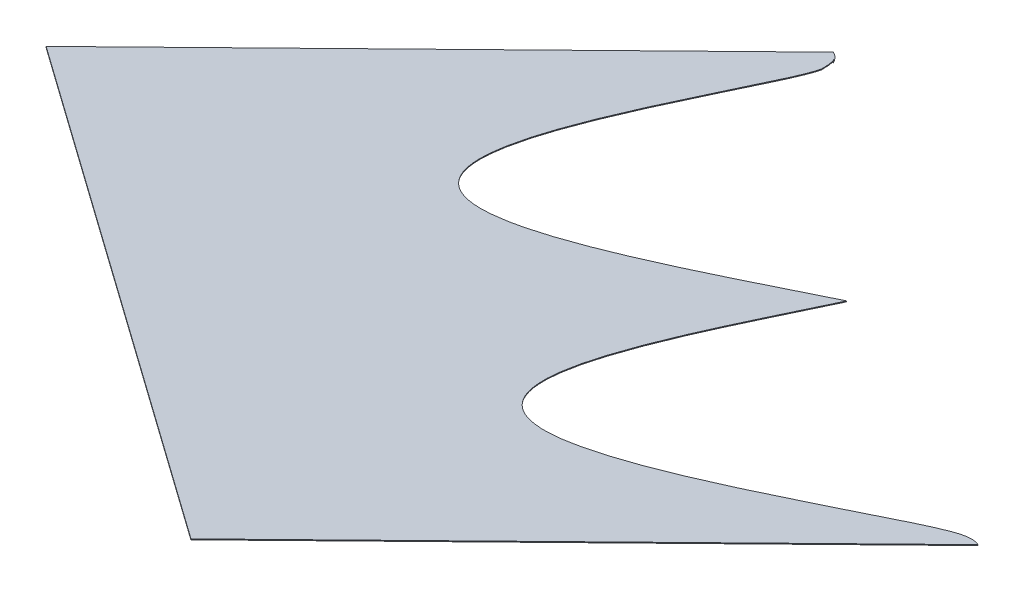
ISO-10303-21;
HEADER;
FILE_DESCRIPTION(('STEP AP214'),'2;1');
FILE_NAME('part.step','',(''),(''),'','','');
FILE_SCHEMA(('AUTOMOTIVE_DESIGN { 1 0 10303 214 1 1 1 1 }'));
ENDSEC;
DATA;
#1=APPLICATION_CONTEXT('core data for automotive mechanical design processes');
#2=APPLICATION_PROTOCOL_DEFINITION('international standard','automotive_design',2000,#1);
#3=PRODUCT_CONTEXT('',#1,'mechanical');
#4=PRODUCT('Part','Part','',(#3));
#5=PRODUCT_RELATED_PRODUCT_CATEGORY('part','',(#4));
#6=PRODUCT_DEFINITION_FORMATION('','',#4);
#7=PRODUCT_DEFINITION_CONTEXT('part definition',#1,'design');
#8=PRODUCT_DEFINITION('design','',#6,#7);
#9=PRODUCT_DEFINITION_SHAPE('','',#8);
#10=(LENGTH_UNIT() NAMED_UNIT(*) SI_UNIT(.MILLI.,.METRE.));
#11=(NAMED_UNIT(*) PLANE_ANGLE_UNIT() SI_UNIT($,.RADIAN.));
#12=(NAMED_UNIT(*) SI_UNIT($,.STERADIAN.) SOLID_ANGLE_UNIT());
#13=UNCERTAINTY_MEASURE_WITH_UNIT(LENGTH_MEASURE(1.E-05),#10,'distance_accuracy_value','');
#14=(GEOMETRIC_REPRESENTATION_CONTEXT(3) GLOBAL_UNCERTAINTY_ASSIGNED_CONTEXT((#13)) GLOBAL_UNIT_ASSIGNED_CONTEXT((#10,
#11,#12)) REPRESENTATION_CONTEXT('',''));
#15=CARTESIAN_POINT('',(0.,0.,0.));
#16=DIRECTION('',(0.,0.,1.));
#17=DIRECTION('',(1.,0.,0.));
#18=AXIS2_PLACEMENT_3D('',#15,#16,#17);
#19=CARTESIAN_POINT('',(1079.11560137537,85.7924278431009,-318.004491804373));
#20=CARTESIAN_POINT('',(1079.25158330935,85.792450728008,-317.964564471529));
#21=CARTESIAN_POINT('',(1079.37115136888,85.7936431109959,-317.919641101963));
#22=B_SPLINE_CURVE_WITH_KNOTS('',2,(#19,#20,#21),.UNSPECIFIED.,.F.,.F.,(3,3),(0.,1.),.UNSPECIFIED.);
#23=DIRECTION('',(-0.0346317771892169,-0.992348088141897,0.118515450342299));
#24=VECTOR('',#23,1.);
#25=SURFACE_OF_LINEAR_EXTRUSION('',#22,#24);
#26=CARTESIAN_POINT('',(1079.11213819765,85.6931930342867,-317.992640259338));
#27=CARTESIAN_POINT('',(1079.24812013163,85.6932159191938,-317.952712926495));
#28=CARTESIAN_POINT('',(1079.36768819116,85.6944083021817,-317.907789556928));
#29=B_SPLINE_CURVE_WITH_KNOTS('',2,(#26,#27,#28),.UNSPECIFIED.,.F.,.F.,(3,3),(0.,1.),.UNSPECIFIED.);
#30=CARTESIAN_POINT('',(1079.11213819765,85.6931930342867,-317.992640259338));
#31=VERTEX_POINT('',#30);
#32=CARTESIAN_POINT('',(1079.36768819116,85.6944083021816,-317.907789556929));
#33=VERTEX_POINT('',#32);
#34=EDGE_CURVE('E190',#31,#33,#29,.T.);
#35=ORIENTED_EDGE('',*,*,#34,.F.);
#36=DIRECTION('',(-0.0346317771892169,-0.992348088141897,0.118515450342299));
#37=VECTOR('',#36,1.);
#38=CARTESIAN_POINT('',(1079.11560137537,85.7924278431009,-318.004491804372));
#39=LINE('',#38,#37);
#40=CARTESIAN_POINT('',(1079.11560137537,85.7924278431009,-318.004491804372));
#41=VERTEX_POINT('',#40);
#42=EDGE_CURVE('E13',#41,#31,#39,.T.);
#43=ORIENTED_EDGE('',*,*,#42,.F.);
#44=CARTESIAN_POINT('',(1079.37115136888,85.7936431109959,-317.919641101963));
#45=VERTEX_POINT('',#44);
#46=EDGE_CURVE('E344',#41,#45,#22,.T.);
#47=ORIENTED_EDGE('',*,*,#46,.T.);
#48=DIRECTION('',(-0.0346317771892169,-0.992348088141897,0.118515450342299));
#49=VECTOR('',#48,1.);
#50=CARTESIAN_POINT('',(1079.37115136888,85.7936431109959,-317.919641101963));
#51=LINE('',#50,#49);
#52=EDGE_CURVE('E128',#45,#33,#51,.T.);
#53=ORIENTED_EDGE('',*,*,#52,.T.);
#54=EDGE_LOOP('',(#35,#43,#47,#53));
#55=FACE_BOUND('',#54,.T.);
#56=ADVANCED_FACE('F58',(#55),#25,.T.);
#57=CARTESIAN_POINT('',(1079.11560137537,85.7924278431009,-318.004491804372));
#58=CARTESIAN_POINT('',(1078.81051230708,85.7933883671713,-318.08560023693));
#59=CARTESIAN_POINT('',(1078.19194149172,85.817644649016,-318.063253207468));
#60=CARTESIAN_POINT('',(1077.58193516638,85.8578302220282,-317.905025116934));
#61=CARTESIAN_POINT('',(1076.99590314881,85.9062234610284,-317.67106736828));
#62=CARTESIAN_POINT('',(1076.2066690221,85.9795604529384,-317.287630076734));
#63=CARTESIAN_POINT('',(1075.5827780901,86.0444550647695,-316.926566670148));
#64=CARTESIAN_POINT('',(1075.10486538717,86.0941656115252,-316.649985011849));
#65=CARTESIAN_POINT('',(1074.50831292347,86.1593358854223,-316.278624783506));
#66=CARTESIAN_POINT('',(1073.66118071325,86.2518807017246,-315.751276008385));
#67=CARTESIAN_POINT('',(1072.40099468496,86.3948515177153,-314.922402356252));
#68=CARTESIAN_POINT('',(1071.62840304332,86.4825037015613,-314.414238608018));
#69=CARTESIAN_POINT('',(1070.31340297579,86.6331733812299,-313.53691857154));
#70=CARTESIAN_POINT('',(1070.3014642302,86.6345412952079,-313.528953476348));
#71=CARTESIAN_POINT('',(1069.27116207446,86.7526356910174,-312.841198816756));
#72=CARTESIAN_POINT('',(1068.65455820699,86.8233115221574,-312.429598995665));
#73=CARTESIAN_POINT('',(1068.2282387323,86.872099604144,-312.145665055174));
#74=CARTESIAN_POINT('',(1067.06080122107,87.0057013755712,-311.368137514158));
#75=CARTESIAN_POINT('',(1066.13940176238,87.110336549803,-310.761256182334));
#76=CARTESIAN_POINT('',(1063.82251251541,87.373445137229,-309.235233110992));
#77=CARTESIAN_POINT('',(1061.94356775731,87.5803283533626,-308.052020564607));
#78=CARTESIAN_POINT('',(1059.64831198028,87.833049938153,-306.606647878244));
#79=CARTESIAN_POINT('',(1057.68485398648,88.037603818056,-305.467635104027));
#80=CARTESIAN_POINT('',(1055.31090560422,88.2849227593384,-304.090494599237));
#81=CARTESIAN_POINT('',(1053.2955238117,88.475095998243,-303.087065961794));
#82=CARTESIAN_POINT('',(1050.73266220442,88.7169299249603,-301.811055262439));
#83=CARTESIAN_POINT('',(1048.65788764754,88.8750304368261,-301.093531848681));
#84=CARTESIAN_POINT('',(1047.35293908793,88.9744692093659,-300.642238891495));
#85=CARTESIAN_POINT('',(1046.22453512211,89.0421299855224,-300.40543932607));
#86=CARTESIAN_POINT('',(1044.82782804648,89.1258786142603,-300.112335403581));
#87=CARTESIAN_POINT('',(1043.68894625372,89.1616776805252,-300.145380593177));
#88=CARTESIAN_POINT('',(1043.12539254736,89.1793921585387,-300.161732368393));
#89=CARTESIAN_POINT('',(1041.96923952346,89.1933132057905,-300.38301245651));
#90=CARTESIAN_POINT('',(1041.14065839689,89.1754723745019,-300.774518809856));
#91=CARTESIAN_POINT('',(1040.63754780833,89.1536324706326,-301.104403230339));
#92=CARTESIAN_POINT('',(1039.95521392498,89.1056329182009,-301.705697820187));
#93=CARTESIAN_POINT('',(1039.43861924964,89.0295509306826,-302.493699775034));
#94=CARTESIAN_POINT('',(1039.16885450018,88.9758493780716,-303.022179948545));
#95=CARTESIAN_POINT('',(1038.83424711106,88.8883497817988,-303.852604212521));
#96=CARTESIAN_POINT('',(1038.54713204883,88.7536168034094,-305.064642963268));
#97=CARTESIAN_POINT('',(1038.38770687923,88.6130031904483,-306.288608501277));
#98=CARTESIAN_POINT('',(1038.32523347803,88.4703814202857,-307.501058063288));
#99=CARTESIAN_POINT('',(1038.33225082657,88.2667512626605,-309.204034120615));
#100=CARTESIAN_POINT('',(1038.49264339123,88.0349344275506,-311.098203302017));
#101=CARTESIAN_POINT('',(1038.64138767135,87.8786112033686,-312.363656653869));
#102=CARTESIAN_POINT('',(1038.89072679115,87.6621281031865,-314.10344275892));
#103=CARTESIAN_POINT('',(1039.33008793638,87.3591347664427,-316.512065434913));
#104=CARTESIAN_POINT('',(1039.60535322406,87.1956670486443,-317.800369623763));
#105=CARTESIAN_POINT('',(1039.84161422798,87.0553622269126,-318.906124888394));
#106=CARTESIAN_POINT('',(1040.4024274629,86.7520932717532,-321.281565457838));
#107=CARTESIAN_POINT('',(1040.72389675444,86.5901029085434,-322.543998110448));
#108=CARTESIAN_POINT('',(1040.99844725728,86.4517552129944,-323.622177360211));
#109=CARTESIAN_POINT('',(1041.44480473919,86.2371760681495,-325.288449991425));
#110=CARTESIAN_POINT('',(1041.77461648188,86.0811184485172,-326.498769095649));
#111=CARTESIAN_POINT('',(1042.13878384908,85.9123178939733,-327.805747586732));
#112=CARTESIAN_POINT('',(1042.46950793571,85.7608817388234,-328.977103859341));
#113=CARTESIAN_POINT('',(1042.64123598148,85.6830297701716,-329.578789163876));
#114=CARTESIAN_POINT('',(1042.77360794149,85.6230196673696,-330.042582149525));
#115=CARTESIAN_POINT('',(1043.03424549293,85.5055330795497,-330.950153684593));
#116=CARTESIAN_POINT('',(1043.18008081047,85.4399234510108,-331.456898189614));
#117=CARTESIAN_POINT('',(1043.28683729763,85.3919346872526,-331.827519833998));
#118=CARTESIAN_POINT('',(1043.38650585486,85.3471567727719,-332.173327730276));
#119=CARTESIAN_POINT('',(1043.51814425932,85.2879633634768,-332.630496770223));
#120=CARTESIAN_POINT('',(1043.66084060617,85.2237646299408,-333.126344883072));
#121=CARTESIAN_POINT('',(1043.82310029574,85.1506481476863,-333.691146010414));
#122=CARTESIAN_POINT('',(1043.95044313584,85.0931195799746,-334.135630296347));
#123=CARTESIAN_POINT('',(1044.00357355406,85.0689993328928,-334.322067425072));
#124=CARTESIAN_POINT('',(1044.40366330488,84.8873658361532,-335.726001120177));
#125=CARTESIAN_POINT('',(1044.6549793891,84.7672684803609,-336.658156872522));
#126=B_SPLINE_CURVE_WITH_KNOTS('',2,(#57,#58,#59,#60,#61,#62,#63,#64,#65,#66,#67,#68,#69,#70,
#71,#72,#73,#74,#75,#76,#77,#78,#79,#80,#81,#82,#83,#84,#85,#86,#87,#88,#89,#90,#91,#92,#93,#94,
#95,#96,#97,#98,#99,#100,#101,#102,#103,#104,#105,#106,#107,#108,#109,#110,#111,#112,#113,#114,
#115,#116,#117,#118,#119,#120,#121,#122,#123,#124,#125),.UNSPECIFIED.,.F.,.F.,(3,1,1,1,1,2,2,2,
2,2,2,2,2,2,2,2,2,2,1,1,1,1,1,1,1,1,1,1,1,1,1,1,1,2,1,2,1,1,1,1,2,1,1,1,1,1,1,1,1,2,3),(0.,
0.0078125,0.015625,0.0234375,0.03125,0.046875,0.0625,0.09375,0.125,0.140625,0.15625,0.1875,0.25,
0.3125,0.375,0.4375,0.46875,0.5,0.513179779052734,0.528392910957336,0.535999476909637,
0.543606042861938,0.558819174766541,0.566425740718842,0.574032306671143,0.589245438575745,
0.604458570480347,0.619671702384949,0.634884834289551,0.665311098098755,0.680524230003357,
0.695737361907959,0.726163625717163,0.756589889526367,0.787016153335571,0.817442417144775,
0.847868680953979,0.860039186477661,0.878294944763184,0.893508076667786,0.908721208572388,
0.92393434047699,0.931540906429291,0.935344189405441,0.939147472381592,0.943494081497192,
0.946754038333893,0.954360604286194,0.961967170238495,0.969573736190796,1.),.UNSPECIFIED.);
#127=DIRECTION('',(-0.0346317771892169,-0.992348088141897,0.118515450342299));
#128=VECTOR('',#127,1.);
#129=SURFACE_OF_LINEAR_EXTRUSION('',#126,#128);
#130=CARTESIAN_POINT('',(1079.11213819765,85.6931930342867,-317.992640259338));
#131=CARTESIAN_POINT('',(1078.80704912936,85.6941535583571,-318.073748691895));
#132=CARTESIAN_POINT('',(1078.188478314,85.7184098402018,-318.051401662433));
#133=CARTESIAN_POINT('',(1077.57847198866,85.7585954132139,-317.8931735719));
#134=CARTESIAN_POINT('',(1076.99243997109,85.8069886522142,-317.659215823245));
#135=CARTESIAN_POINT('',(1076.20320584438,85.8803256441242,-317.2757785317));
#136=CARTESIAN_POINT('',(1075.57931491238,85.9452202559553,-316.914715125113));
#137=CARTESIAN_POINT('',(1075.10140220945,85.994930802711,-316.638133466814));
#138=CARTESIAN_POINT('',(1074.50484974575,86.0601010766081,-316.266773238472));
#139=CARTESIAN_POINT('',(1073.65771753554,86.1526458929104,-315.739424463351));
#140=CARTESIAN_POINT('',(1072.39753150724,86.2956167089011,-314.910550811218));
#141=CARTESIAN_POINT('',(1071.6249398656,86.3832688927471,-314.402387062984));
#142=CARTESIAN_POINT('',(1070.30993979807,86.5339385724156,-313.525067026505));
#143=CARTESIAN_POINT('',(1070.29800105248,86.5353064863937,-313.517101931314));
#144=CARTESIAN_POINT('',(1069.26769889674,86.6534008822032,-312.829347271722));
#145=CARTESIAN_POINT('',(1068.65109502927,86.7240767133432,-312.41774745063));
#146=CARTESIAN_POINT('',(1068.22477555458,86.7728647953298,-312.13381351014));
#147=CARTESIAN_POINT('',(1067.05733804335,86.906466566757,-311.356285969124));
#148=CARTESIAN_POINT('',(1066.13593858466,87.0111017409888,-310.749404637299));
#149=CARTESIAN_POINT('',(1063.81904933769,87.2742103284148,-309.223381565957));
#150=CARTESIAN_POINT('',(1061.94010457959,87.4810935445484,-308.040169019572));
#151=CARTESIAN_POINT('',(1059.64484880257,87.7338151293388,-306.59479633321));
#152=CARTESIAN_POINT('',(1057.68139080876,87.9383690092418,-305.455783558993));
#153=CARTESIAN_POINT('',(1055.3074424265,88.1856879505242,-304.078643054203));
#154=CARTESIAN_POINT('',(1053.29206063398,88.3758611894288,-303.07521441676));
#155=CARTESIAN_POINT('',(1050.7291990267,88.6176951161461,-301.799203717404));
#156=CARTESIAN_POINT('',(1048.65442446982,88.7757956280119,-301.081680303647));
#157=CARTESIAN_POINT('',(1047.34947591021,88.8752344005517,-300.630387346461));
#158=CARTESIAN_POINT('',(1046.22107194439,88.9428951767082,-300.393587781036));
#159=CARTESIAN_POINT('',(1044.82436486876,89.0266438054461,-300.100483858547));
#160=CARTESIAN_POINT('',(1043.685483076,89.062442871711,-300.133529048142));
#161=CARTESIAN_POINT('',(1043.12192936964,89.0801573497244,-300.149880823359));
#162=CARTESIAN_POINT('',(1041.96577634574,89.0940783969763,-300.371160911476));
#163=CARTESIAN_POINT('',(1041.13719521918,89.0762375656877,-300.762667264822));
#164=CARTESIAN_POINT('',(1040.63408463062,89.0543976618184,-301.092551685305));
#165=CARTESIAN_POINT('',(1039.95175074726,89.0063981093867,-301.693846275153));
#166=CARTESIAN_POINT('',(1039.43515607192,88.9303161218684,-302.48184823));
#167=CARTESIAN_POINT('',(1039.16539132246,88.8766145692573,-303.010328403511));
#168=CARTESIAN_POINT('',(1038.83078393334,88.7891149729846,-303.840752667487));
#169=CARTESIAN_POINT('',(1038.54366887112,88.6543819945952,-305.052791418234));
#170=CARTESIAN_POINT('',(1038.38424370151,88.5137683816341,-306.276756956243));
#171=CARTESIAN_POINT('',(1038.32177030031,88.3711466114715,-307.489206518254));
#172=CARTESIAN_POINT('',(1038.32878764885,88.1675164538463,-309.192182575581));
#173=CARTESIAN_POINT('',(1038.48918021351,87.9356996187364,-311.086351756982));
#174=CARTESIAN_POINT('',(1038.63792449363,87.7793763945544,-312.351805108835));
#175=CARTESIAN_POINT('',(1038.88726361343,87.5628932943722,-314.091591213885));
#176=CARTESIAN_POINT('',(1039.32662475867,87.2598999576285,-316.500213889879));
#177=CARTESIAN_POINT('',(1039.60189004634,87.0964322398301,-317.788518078729));
#178=CARTESIAN_POINT('',(1039.83815105026,86.9561274180984,-318.89427334336));
#179=CARTESIAN_POINT('',(1040.39896428518,86.652858462939,-321.269713912804));
#180=CARTESIAN_POINT('',(1040.72043357672,86.4908680997292,-322.532146565414));
#181=CARTESIAN_POINT('',(1040.99498407956,86.3525204041802,-323.610325815177));
#182=CARTESIAN_POINT('',(1041.44134156147,86.1379412593353,-325.276598446391));
#183=CARTESIAN_POINT('',(1041.77115330416,85.981883639703,-326.486917550614));
#184=CARTESIAN_POINT('',(1042.13532067136,85.8130830851591,-327.793896041698));
#185=CARTESIAN_POINT('',(1042.46604475799,85.6616469300091,-328.965252314307));
#186=CARTESIAN_POINT('',(1042.63777280376,85.5837949613574,-329.566937618842));
#187=CARTESIAN_POINT('',(1042.77014476377,85.5237848585554,-330.03073060449));
#188=CARTESIAN_POINT('',(1043.03078231522,85.4062982707354,-330.938302139559));
#189=CARTESIAN_POINT('',(1043.17661763275,85.3406886421966,-331.44504664458));
#190=CARTESIAN_POINT('',(1043.28337411991,85.2926998784384,-331.815668288964));
#191=CARTESIAN_POINT('',(1043.38304267714,85.2479219639577,-332.161476185241));
#192=CARTESIAN_POINT('',(1043.5146810816,85.1887285546625,-332.618645225189));
#193=CARTESIAN_POINT('',(1043.65737742845,85.1245298211266,-333.114493338038));
#194=CARTESIAN_POINT('',(1043.81963711803,85.0514133388721,-333.67929446538));
#195=CARTESIAN_POINT('',(1043.94697995812,84.9938847711604,-334.123778751312));
#196=CARTESIAN_POINT('',(1044.00011037634,84.9697645240786,-334.310215880038));
#197=CARTESIAN_POINT('',(1044.40020012716,84.788131027339,-335.714149575143));
#198=CARTESIAN_POINT('',(1044.65151621138,84.6680336715467,-336.646305327488));
#199=B_SPLINE_CURVE_WITH_KNOTS('',2,(#130,#131,#132,#133,#134,#135,#136,#137,#138,#139,#140,
#141,#142,#143,#144,#145,#146,#147,#148,#149,#150,#151,#152,#153,#154,#155,#156,#157,#158,#159,
#160,#161,#162,#163,#164,#165,#166,#167,#168,#169,#170,#171,#172,#173,#174,#175,#176,#177,#178,
#179,#180,#181,#182,#183,#184,#185,#186,#187,#188,#189,#190,#191,#192,#193,#194,#195,#196,#197,
#198),.UNSPECIFIED.,.F.,.F.,(3,1,1,1,1,2,2,2,2,2,2,2,2,2,2,2,2,2,1,1,1,1,1,1,1,1,1,1,1,1,1,1,1,
2,1,2,1,1,1,1,2,1,1,1,1,1,1,1,1,2,3),(0.,0.0078125,0.015625,0.0234375,0.03125,0.046875,0.0625,
0.09375,0.125,0.140625,0.15625,0.1875,0.25,0.3125,0.375,0.4375,0.46875,0.5,0.513179779052734,
0.528392910957336,0.535999476909637,0.543606042861938,0.558819174766541,0.566425740718842,
0.574032306671143,0.589245438575745,0.604458570480347,0.619671702384949,0.634884834289551,
0.665311098098755,0.680524230003357,0.695737361907959,0.726163625717163,0.756589889526367,
0.787016153335571,0.817442417144775,0.847868680953979,0.860039186477661,0.878294944763184,
0.893508076667786,0.908721208572388,0.92393434047699,0.931540906429291,0.935344189405441,
0.939147472381592,0.943494081497192,0.946754038333893,0.954360604286194,0.961967170238495,
0.969573736190796,1.),.UNSPECIFIED.);
#200=CARTESIAN_POINT('',(1044.65151558521,84.6680337413843,-336.646304925704));
#201=VERTEX_POINT('',#200);
#202=EDGE_CURVE('E277',#31,#201,#199,.T.);
#203=ORIENTED_EDGE('',*,*,#202,.T.);
#204=DIRECTION('',(-0.0346317771892169,-0.992348088141897,0.118515450342299));
#205=VECTOR('',#204,1.);
#206=CARTESIAN_POINT('',(1044.65497876293,84.7672685501985,-336.658156470738));
#207=LINE('',#206,#205);
#208=CARTESIAN_POINT('',(1044.65497876293,84.7672685501985,-336.658156470738));
#209=VERTEX_POINT('',#208);
#210=EDGE_CURVE('E67',#209,#201,#207,.T.);
#211=ORIENTED_EDGE('',*,*,#210,.F.);
#212=EDGE_CURVE('E362',#41,#209,#126,.T.);
#213=ORIENTED_EDGE('',*,*,#212,.F.);
#214=ORIENTED_EDGE('',*,*,#42,.T.);
#215=EDGE_LOOP('',(#203,#211,#213,#214));
#216=FACE_BOUND('',#215,.T.);
#217=ADVANCED_FACE('F350',(#216),#129,.F.);
#218=CARTESIAN_POINT('',(1044.6549793891,84.7672684803607,-336.658156872524));
#219=CARTESIAN_POINT('',(1043.8338750541,84.8588467985918,-336.131295046047));
#220=CARTESIAN_POINT('',(1042.60362729394,84.9990177808628,-335.317116475461));
#221=CARTESIAN_POINT('',(1042.01757315712,85.0657911469133,-334.929265560504));
#222=CARTESIAN_POINT('',(1040.5617957332,85.2323582680112,-333.959970802269));
#223=CARTESIAN_POINT('',(1039.27292112243,85.3798287053497,-333.101804310799));
#224=CARTESIAN_POINT('',(1038.51970166111,85.4656639372789,-332.603193373824));
#225=CARTESIAN_POINT('',(1037.41023961166,85.5920957904403,-331.86875946654));
#226=CARTESIAN_POINT('',(1036.47439767709,85.6977239002442,-331.25778441437));
#227=CARTESIAN_POINT('',(1034.22095899422,85.9520686350124,-329.786601337416));
#228=CARTESIAN_POINT('',(1032.35241509516,86.1558888209741,-328.625996745475));
#229=CARTESIAN_POINT('',(1030.0897664267,86.4026978323128,-327.220602718673));
#230=CARTESIAN_POINT('',(1028.14731529983,86.6022774737425,-326.117101524521));
#231=CARTESIAN_POINT('',(1025.7967780642,86.8437864477224,-324.781767723558));
#232=CARTESIAN_POINT('',(1023.80434955492,87.0275921113288,-323.824948521139));
#233=CARTESIAN_POINT('',(1021.28451022151,87.2600525176634,-322.614852073516));
#234=CARTESIAN_POINT('',(1019.25350274465,87.4079784438475,-321.969732712233));
#235=CARTESIAN_POINT('',(1017.96392108611,87.5019035344255,-321.56011625077));
#236=CARTESIAN_POINT('',(1016.8556002321,87.5629882902646,-321.3725101645));
#237=CARTESIAN_POINT('',(1015.49348239924,87.638060986897,-321.141943722718));
#238=CARTESIAN_POINT('',(1014.39294893943,87.664186005615,-321.244785311359));
#239=CARTESIAN_POINT('',(1013.03452978617,87.6964328450816,-321.371725553401));
#240=CARTESIAN_POINT('',(1011.05867713718,87.6113014239757,-322.661914226964));
#241=CARTESIAN_POINT('',(1010.44936827396,87.489454856318,-323.860202355997));
#242=CARTESIAN_POINT('',(1009.95010422429,87.3896145052582,-324.842072504441));
#243=CARTESIAN_POINT('',(1009.70851933223,87.2359817150764,-326.19905776925));
#244=CARTESIAN_POINT('',(1009.51410216703,87.1123446312557,-327.291101341004));
#245=CARTESIAN_POINT('',(1009.48500562888,86.9529574554835,-328.634177062511));
#246=CARTESIAN_POINT('',(1009.43961076526,86.7042901030922,-330.729572015775));
#247=CARTESIAN_POINT('',(1009.79755418138,86.3637072489492,-333.476728834476));
#248=CARTESIAN_POINT('',(1010.07873534428,86.0961636130597,-335.634747991028));
#249=CARTESIAN_POINT('',(1010.61596319501,85.7651241639372,-338.249607136524));
#250=CARTESIAN_POINT('',(1011.06139679842,85.4906482697761,-340.417674428709));
#251=CARTESIAN_POINT('',(1011.69938801976,85.1625323963685,-342.978609639794));
#252=CARTESIAN_POINT('',(1012.22705470952,84.8911559087463,-345.096695532423));
#253=CARTESIAN_POINT('',(1012.92821568014,84.5620403980394,-347.647541826693));
#254=CARTESIAN_POINT('',(1013.22390261224,84.423248936817,-348.723260451364));
#255=CARTESIAN_POINT('',(1013.57614768977,84.2620691099543,-349.969913268076));
#256=CARTESIAN_POINT('',(1013.84778454732,84.1377738835251,-350.931280438819));
#257=CARTESIAN_POINT('',(1014.23679120274,83.9620628310474,-352.288863224115));
#258=CARTESIAN_POINT('',(1014.25427535082,83.9541653876012,-352.349880633773));
#259=CARTESIAN_POINT('',(1014.5692676628,83.8120030412498,-353.44818291138));
#260=CARTESIAN_POINT('',(1014.77384510714,83.7196731386119,-354.161495155874));
#261=CARTESIAN_POINT('',(1014.9013412823,83.6618835921645,-354.60811985036));
#262=CARTESIAN_POINT('',(1015.30491070474,83.4789597212863,-356.021841240603));
#263=CARTESIAN_POINT('',(1015.55542078664,83.3614000903896,-356.932983756715));
#264=CARTESIAN_POINT('',(1015.94173478513,83.1801102567456,-358.338065364339));
#265=CARTESIAN_POINT('',(1016.16520365274,83.0604657997667,-359.274566249139));
#266=CARTESIAN_POINT('',(1016.32412650207,82.9753790572016,-359.940571275273));
#267=CARTESIAN_POINT('',(1016.4235543958,82.9097583011893,-360.460969813447));
#268=CARTESIAN_POINT('',(1016.55667137139,82.8219033115203,-361.157694614767));
#269=CARTESIAN_POINT('',(1016.59722959588,82.7592403992895,-361.670529165707));
#270=B_SPLINE_CURVE_WITH_KNOTS('',2,(#218,#219,#220,#221,#222,#223,#224,#225,#226,#227,#228,
#229,#230,#231,#232,#233,#234,#235,#236,#237,#238,#239,#240,#241,#242,#243,#244,#245,#246,#247,
#248,#249,#250,#251,#252,#253,#254,#255,#256,#257,#258,#259,#260,#261,#262,#263,#264,#265,#266,
#267,#268,#269),.UNSPECIFIED.,.F.,.F.,(3,2,2,2,2,2,2,2,2,2,2,1,2,2,2,2,2,2,2,2,2,2,2,2,2,2,3),
(0.,0.03125,0.0625,0.09375,0.125,0.1875,0.25,0.3125,0.375,0.40625,0.4375,0.46875,0.5,0.53125,
0.5625,0.625,0.6875,0.75,0.8125,0.84375,0.875,0.890625,0.90625,0.9375,0.96875,0.984375,1.),.UNSPECIFIED.);
#271=DIRECTION('',(-0.0346317771892169,-0.992348088141897,0.118515450342299));
#272=VECTOR('',#271,1.);
#273=SURFACE_OF_LINEAR_EXTRUSION('',#270,#272);
#274=CARTESIAN_POINT('',(1044.65151621138,84.6680336715465,-336.64630532749));
#275=CARTESIAN_POINT('',(1043.83041187638,84.7596119897776,-336.119443501013));
#276=CARTESIAN_POINT('',(1042.60016411622,84.8997829720486,-335.305264930427));
#277=CARTESIAN_POINT('',(1042.0141099794,84.9665563380991,-334.91741401547));
#278=CARTESIAN_POINT('',(1040.55833255548,85.133123459197,-333.948119257235));
#279=CARTESIAN_POINT('',(1039.26945794471,85.2805938965355,-333.089952765765));
#280=CARTESIAN_POINT('',(1038.51623848339,85.3664291284646,-332.59134182879));
#281=CARTESIAN_POINT('',(1037.40677643394,85.4928609816261,-331.856907921506));
#282=CARTESIAN_POINT('',(1036.47093449938,85.59848909143,-331.245932869336));
#283=CARTESIAN_POINT('',(1034.2174958165,85.8528338261982,-329.774749792382));
#284=CARTESIAN_POINT('',(1032.34895191744,86.0566540121599,-328.61414520044));
#285=CARTESIAN_POINT('',(1030.08630324898,86.3034630234986,-327.208751173639));
#286=CARTESIAN_POINT('',(1028.14385212212,86.5030426649283,-326.105249979486));
#287=CARTESIAN_POINT('',(1025.79331488648,86.7445516389081,-324.769916178524));
#288=CARTESIAN_POINT('',(1023.8008863772,86.9283573025146,-323.813096976105));
#289=CARTESIAN_POINT('',(1021.28104704379,87.1608177088492,-322.603000528482));
#290=CARTESIAN_POINT('',(1019.25003956693,87.3087436350333,-321.957881167199));
#291=CARTESIAN_POINT('',(1017.96045790839,87.4026687256113,-321.548264705736));
#292=CARTESIAN_POINT('',(1016.85213705438,87.4637534814504,-321.360658619466));
#293=CARTESIAN_POINT('',(1015.49001922152,87.5388261780828,-321.130092177684));
#294=CARTESIAN_POINT('',(1014.38948576171,87.5649511968008,-321.232933766325));
#295=CARTESIAN_POINT('',(1013.03106660845,87.5971980362674,-321.359874008367));
#296=CARTESIAN_POINT('',(1011.05521395946,87.5120666151615,-322.650062681929));
#297=CARTESIAN_POINT('',(1010.44590509624,87.3902200475038,-323.848350810962));
#298=CARTESIAN_POINT('',(1009.94664104657,87.290379696444,-324.830220959406));
#299=CARTESIAN_POINT('',(1009.70505615451,87.1367469062622,-326.187206224216));
#300=CARTESIAN_POINT('',(1009.51063898931,87.0131098224415,-327.27924979597));
#301=CARTESIAN_POINT('',(1009.48154245116,86.8537226466693,-328.622325517477));
#302=CARTESIAN_POINT('',(1009.43614758754,86.605055294278,-330.71772047074));
#303=CARTESIAN_POINT('',(1009.79409100366,86.264472440135,-333.464877289441));
#304=CARTESIAN_POINT('',(1010.07527216656,85.9969288042455,-335.622896445994));
#305=CARTESIAN_POINT('',(1010.61250001729,85.665889355123,-338.23775559149));
#306=CARTESIAN_POINT('',(1011.05793362071,85.3914134609619,-340.405822883675));
#307=CARTESIAN_POINT('',(1011.69592484204,85.0632975875543,-342.96675809476));
#308=CARTESIAN_POINT('',(1012.2235915318,84.7919210999321,-345.084843987389));
#309=CARTESIAN_POINT('',(1012.92475250242,84.4628055892252,-347.635690281659));
#310=CARTESIAN_POINT('',(1013.22043943452,84.3240141280027,-348.71140890633));
#311=CARTESIAN_POINT('',(1013.57268451205,84.16283430114,-349.958061723042));
#312=CARTESIAN_POINT('',(1013.8443213696,84.0385390747109,-350.919428893785));
#313=CARTESIAN_POINT('',(1014.23332802502,83.8628280222332,-352.277011679081));
#314=CARTESIAN_POINT('',(1014.2508121731,83.8549305787869,-352.338029088738));
#315=CARTESIAN_POINT('',(1014.56580448508,83.7127682324356,-353.436331366346));
#316=CARTESIAN_POINT('',(1014.77038192942,83.6204383297977,-354.14964361084));
#317=CARTESIAN_POINT('',(1014.89787810458,83.5626487833503,-354.596268305326));
#318=CARTESIAN_POINT('',(1015.30144752702,83.3797249124721,-356.009989695569));
#319=CARTESIAN_POINT('',(1015.55195760892,83.2621652815754,-356.921132211681));
#320=CARTESIAN_POINT('',(1015.93827160741,83.0808754479314,-358.326213819305));
#321=CARTESIAN_POINT('',(1016.16174047502,82.9612309909524,-359.262714704105));
#322=CARTESIAN_POINT('',(1016.32066332435,82.8761442483874,-359.928719730238));
#323=CARTESIAN_POINT('',(1016.42009121808,82.8105234923751,-360.449118268413));
#324=CARTESIAN_POINT('',(1016.55320819367,82.7226685027061,-361.145843069733));
#325=CARTESIAN_POINT('',(1016.59376641817,82.6600055904752,-361.658677620673));
#326=B_SPLINE_CURVE_WITH_KNOTS('',2,(#274,#275,#276,#277,#278,#279,#280,#281,#282,#283,#284,
#285,#286,#287,#288,#289,#290,#291,#292,#293,#294,#295,#296,#297,#298,#299,#300,#301,#302,#303,
#304,#305,#306,#307,#308,#309,#310,#311,#312,#313,#314,#315,#316,#317,#318,#319,#320,#321,#322,
#323,#324,#325),.UNSPECIFIED.,.F.,.F.,(3,2,2,2,2,2,2,2,2,2,2,1,2,2,2,2,2,2,2,2,2,2,2,2,2,2,3),
(0.,0.03125,0.0625,0.09375,0.125,0.1875,0.25,0.3125,0.375,0.40625,0.4375,0.46875,0.5,0.53125,
0.5625,0.625,0.6875,0.75,0.8125,0.84375,0.875,0.890625,0.90625,0.9375,0.96875,0.984375,1.),.UNSPECIFIED.);
#327=CARTESIAN_POINT('',(1016.59376621428,82.660005905473,-361.658675042725));
#328=VERTEX_POINT('',#327);
#329=EDGE_CURVE('E270',#201,#328,#326,.T.);
#330=ORIENTED_EDGE('',*,*,#329,.T.);
#331=DIRECTION('',(-0.0346317771892169,-0.992348088141897,0.118515450342299));
#332=VECTOR('',#331,1.);
#333=CARTESIAN_POINT('',(1016.597229392,82.7592407142872,-361.670526587759));
#334=LINE('',#333,#332);
#335=CARTESIAN_POINT('',(1016.597229392,82.7592407142872,-361.670526587759));
#336=VERTEX_POINT('',#335);
#337=EDGE_CURVE('E261',#336,#328,#334,.T.);
#338=ORIENTED_EDGE('',*,*,#337,.F.);
#339=EDGE_CURVE('E271',#209,#336,#270,.T.);
#340=ORIENTED_EDGE('',*,*,#339,.F.);
#341=ORIENTED_EDGE('',*,*,#210,.T.);
#342=EDGE_LOOP('',(#330,#338,#340,#341));
#343=FACE_BOUND('',#342,.T.);
#344=ADVANCED_FACE('F268',(#343),#273,.F.);
#345=CARTESIAN_POINT('',(1016.59722959588,82.7592403992895,-361.670529165707));
#346=CARTESIAN_POINT('',(1016.52863391171,82.6909742585997,-362.262176621345));
#347=CARTESIAN_POINT('',(1016.43481357067,82.6416552608405,-362.702547713311));
#348=CARTESIAN_POINT('',(1016.42688844046,82.6376381377204,-362.738499530391));
#349=CARTESIAN_POINT('',(1016.3621436926,82.6056771829468,-363.025032787858));
#350=CARTESIAN_POINT('',(1016.19142838222,82.5525725023289,-363.519571708354));
#351=CARTESIAN_POINT('',(1016.06453749717,82.5319216070763,-363.729564019135));
#352=B_SPLINE_CURVE_WITH_KNOTS('',2,(#345,#346,#347,#348,#349,#350,#351),.UNSPECIFIED.,.F.,.F.,
(3,1,1,1,1,3),(0.,0.475,0.5,0.5125,0.75,1.),.UNSPECIFIED.);
#353=DIRECTION('',(-0.0346317771892169,-0.992348088141897,0.118515450342299));
#354=VECTOR('',#353,1.);
#355=SURFACE_OF_LINEAR_EXTRUSION('',#352,#354);
#356=CARTESIAN_POINT('',(1016.59376641817,82.6600055904752,-361.658677620673));
#357=CARTESIAN_POINT('',(1016.52517073399,82.5917394497855,-362.25032507631));
#358=CARTESIAN_POINT('',(1016.43135039295,82.5424204520263,-362.690696168277));
#359=CARTESIAN_POINT('',(1016.42342526274,82.5384033289062,-362.726647985357));
#360=CARTESIAN_POINT('',(1016.35868051488,82.5064423741326,-363.013181242824));
#361=CARTESIAN_POINT('',(1016.1879652045,82.4533376935147,-363.50772016332));
#362=CARTESIAN_POINT('',(1016.06107431945,82.4326867982621,-363.7177124741));
#363=B_SPLINE_CURVE_WITH_KNOTS('',2,(#356,#357,#358,#359,#360,#361,#362),.UNSPECIFIED.,.F.,.F.,
(3,1,1,1,1,3),(0.,0.475,0.5,0.5125,0.75,1.),.UNSPECIFIED.);
#364=CARTESIAN_POINT('',(1016.06107622727,82.4326871087514,-363.717709316836));
#365=VERTEX_POINT('',#364);
#366=EDGE_CURVE('E279',#328,#365,#363,.T.);
#367=ORIENTED_EDGE('',*,*,#366,.T.);
#368=DIRECTION('',(-0.0346317771892169,-0.992348088141897,0.118515450342299));
#369=VECTOR('',#368,1.);
#370=CARTESIAN_POINT('',(1016.06453940499,82.5319219175656,-363.729560861871));
#371=LINE('',#370,#369);
#372=CARTESIAN_POINT('',(1016.06453940499,82.5319219175656,-363.729560861871));
#373=VERTEX_POINT('',#372);
#374=EDGE_CURVE('E258',#373,#365,#371,.T.);
#375=ORIENTED_EDGE('',*,*,#374,.F.);
#376=EDGE_CURVE('E376',#336,#373,#352,.T.);
#377=ORIENTED_EDGE('',*,*,#376,.F.);
#378=ORIENTED_EDGE('',*,*,#337,.T.);
#379=EDGE_LOOP('',(#367,#375,#377,#378));
#380=FACE_BOUND('',#379,.T.);
#381=ADVANCED_FACE('F357',(#380),#355,.F.);
#382=CARTESIAN_POINT('',(1016.06453749717,82.5319216070764,-363.729564019135));
#383=CARTESIAN_POINT('',(1016.23740308037,82.55372725761,-363.496468351871));
#384=CARTESIAN_POINT('',(1016.40570694707,82.5746501444617,-363.27209719435));
#385=B_SPLINE_CURVE_WITH_KNOTS('',2,(#382,#383,#384),.UNSPECIFIED.,.F.,.F.,(3,3),(0.,1.),.UNSPECIFIED.);
#386=DIRECTION('',(-0.0346317771892169,-0.992348088141897,0.118515450342299));
#387=VECTOR('',#386,1.);
#388=SURFACE_OF_LINEAR_EXTRUSION('',#385,#387);
#389=CARTESIAN_POINT('',(1016.06107431945,82.4326867982622,-363.7177124741));
#390=CARTESIAN_POINT('',(1016.23393990265,82.4544924487958,-363.484616806837));
#391=CARTESIAN_POINT('',(1016.40224376935,82.4754153356474,-363.260245649316));
#392=B_SPLINE_CURVE_WITH_KNOTS('',2,(#389,#390,#391),.UNSPECIFIED.,.F.,.F.,(3,3),(0.,1.),.UNSPECIFIED.);
#393=CARTESIAN_POINT('',(1016.40224242973,82.4754151691104,-363.260247435212));
#394=VERTEX_POINT('',#393);
#395=EDGE_CURVE('E281',#365,#394,#392,.T.);
#396=ORIENTED_EDGE('',*,*,#395,.T.);
#397=DIRECTION('',(-0.0346317771892169,-0.992348088141897,0.118515450342299));
#398=VECTOR('',#397,1.);
#399=CARTESIAN_POINT('',(1016.40570560745,82.5746499779246,-363.272098980246));
#400=LINE('',#399,#398);
#401=CARTESIAN_POINT('',(1016.40570560745,82.5746499779246,-363.272098980246));
#402=VERTEX_POINT('',#401);
#403=EDGE_CURVE('E255',#402,#394,#400,.T.);
#404=ORIENTED_EDGE('',*,*,#403,.F.);
#405=EDGE_CURVE('E384',#373,#402,#385,.T.);
#406=ORIENTED_EDGE('',*,*,#405,.F.);
#407=ORIENTED_EDGE('',*,*,#374,.T.);
#408=EDGE_LOOP('',(#396,#404,#406,#407));
#409=FACE_BOUND('',#408,.T.);
#410=ADVANCED_FACE('F394',(#409),#388,.F.);
#411=CARTESIAN_POINT('',(1016.40570694707,82.5746501444616,-363.27209719435));
#412=CARTESIAN_POINT('',(1016.30913675517,82.5520842234362,-363.489264204065));
#413=CARTESIAN_POINT('',(1016.02455593132,82.5169448747464,-363.866649642381));
#414=CARTESIAN_POINT('',(1015.83594603161,82.5029550075737,-364.038903250714));
#415=B_SPLINE_CURVE_WITH_KNOTS('',2,(#411,#412,#413,#414),.UNSPECIFIED.,.F.,.F.,(3,1,3),(0.,0.5,
1.),.UNSPECIFIED.);
#416=DIRECTION('',(-0.0346317771892169,-0.992348088141897,0.118515450342299));
#417=VECTOR('',#416,1.);
#418=SURFACE_OF_LINEAR_EXTRUSION('',#415,#417);
#419=CARTESIAN_POINT('',(1016.40224376935,82.4754153356474,-363.260245649316));
#420=CARTESIAN_POINT('',(1016.30567357745,82.452849414622,-363.477412659031));
#421=CARTESIAN_POINT('',(1016.0210927536,82.4177100659322,-363.854798097347));
#422=CARTESIAN_POINT('',(1015.83248285389,82.4037201987595,-364.02705170568));
#423=B_SPLINE_CURVE_WITH_KNOTS('',2,(#419,#420,#421,#422),.UNSPECIFIED.,.F.,.F.,(3,1,3),(0.,0.5,
1.),.UNSPECIFIED.);
#424=CARTESIAN_POINT('',(1015.83248474274,82.4037203388626,-364.027049980627));
#425=VERTEX_POINT('',#424);
#426=EDGE_CURVE('E299',#394,#425,#423,.T.);
#427=ORIENTED_EDGE('',*,*,#426,.T.);
#428=DIRECTION('',(-0.0346317771892169,-0.992348088141897,0.118515450342299));
#429=VECTOR('',#428,1.);
#430=CARTESIAN_POINT('',(1015.83594792046,82.5029551476768,-364.038901525662));
#431=LINE('',#430,#429);
#432=CARTESIAN_POINT('',(1015.83594792046,82.5029551476768,-364.038901525662));
#433=VERTEX_POINT('',#432);
#434=EDGE_CURVE('E252',#433,#425,#431,.T.);
#435=ORIENTED_EDGE('',*,*,#434,.F.);
#436=EDGE_CURVE('E404',#402,#433,#415,.T.);
#437=ORIENTED_EDGE('',*,*,#436,.F.);
#438=ORIENTED_EDGE('',*,*,#403,.T.);
#439=EDGE_LOOP('',(#427,#435,#437,#438));
#440=FACE_BOUND('',#439,.T.);
#441=ADVANCED_FACE('F398',(#440),#418,.F.);
#442=CARTESIAN_POINT('',(1015.83594603161,82.5029550075737,-364.038903250714));
#443=DIRECTION('',(0.80560853488297,-0.0978977866038361,-0.584303783918763));
#444=DIRECTION('',(-0.587124049106673,0.,-0.80949697402806));
#445=AXIS2_PLACEMENT_3D('',#442,#443,#444);
#446=PLANE('',#445);
#447=CARTESIAN_POINT('',(1015.83248285389,82.4037201987595,-364.02705170568));
#448=CARTESIAN_POINT('',(1015.85841921106,82.4070197870777,-363.99184479983));
#449=B_SPLINE_CURVE_WITH_KNOTS('',1,(#447,#448),.UNSPECIFIED.,.F.,.F.,(2,2),(0.,1.),.UNSPECIFIED.);
#450=CARTESIAN_POINT('',(1015.85841715263,82.4070195252072,-363.991847594012));
#451=VERTEX_POINT('',#450);
#452=EDGE_CURVE('E306',#425,#451,#449,.T.);
#453=ORIENTED_EDGE('',*,*,#452,.T.);
#454=DIRECTION('',(-0.0346317771892169,-0.992348088141897,0.118515450342299));
#455=VECTOR('',#454,1.);
#456=CARTESIAN_POINT('',(1015.86188033035,82.5062543340214,-364.003699139046));
#457=LINE('',#456,#455);
#458=CARTESIAN_POINT('',(1015.86188033035,82.5062543340214,-364.003699139046));
#459=VERTEX_POINT('',#458);
#460=EDGE_CURVE('E249',#459,#451,#457,.T.);
#461=ORIENTED_EDGE('',*,*,#460,.F.);
#462=CARTESIAN_POINT('',(1015.83594603161,82.5029550075737,-364.038903250714));
#463=CARTESIAN_POINT('',(1015.86188238878,82.5062545958919,-364.003696344864));
#464=B_SPLINE_CURVE_WITH_KNOTS('',1,(#462,#463),.UNSPECIFIED.,.F.,.F.,(2,2),(0.,1.),.UNSPECIFIED.);
#465=EDGE_CURVE('E409',#433,#459,#464,.T.);
#466=ORIENTED_EDGE('',*,*,#465,.F.);
#467=ORIENTED_EDGE('',*,*,#434,.T.);
#468=EDGE_LOOP('',(#453,#461,#466,#467));
#469=FACE_BOUND('',#468,.T.);
#470=ADVANCED_FACE('F402',(#469),#446,.F.);
#471=CARTESIAN_POINT('',(1015.86188238878,82.5062545958919,-364.003696344865));
#472=CARTESIAN_POINT('',(1015.81765514092,82.5019593548936,-364.052584843113));
#473=CARTESIAN_POINT('',(1015.76975226893,82.4982414082222,-364.09771363303));
#474=B_SPLINE_CURVE_WITH_KNOTS('',2,(#471,#472,#473),.UNSPECIFIED.,.F.,.F.,(3,3),(0.,1.),.UNSPECIFIED.);
#475=DIRECTION('',(-0.0346317771892169,-0.992348088141897,0.118515450342299));
#476=VECTOR('',#475,1.);
#477=SURFACE_OF_LINEAR_EXTRUSION('',#474,#476);
#478=CARTESIAN_POINT('',(1015.85841921106,82.4070197870776,-363.991844799831));
#479=CARTESIAN_POINT('',(1015.8141919632,82.4027245460794,-364.040733298079));
#480=CARTESIAN_POINT('',(1015.76628909122,82.399006599408,-364.085862087996));
#481=B_SPLINE_CURVE_WITH_KNOTS('',2,(#478,#479,#480),.UNSPECIFIED.,.F.,.F.,(3,3),(0.,1.),.UNSPECIFIED.);
#482=CARTESIAN_POINT('',(1015.76628909122,82.399006599408,-364.085862087996));
#483=VERTEX_POINT('',#482);
#484=EDGE_CURVE('E313',#451,#483,#481,.T.);
#485=ORIENTED_EDGE('',*,*,#484,.T.);
#486=DIRECTION('',(-0.0346317771892169,-0.992348088141897,0.118515450342299));
#487=VECTOR('',#486,1.);
#488=CARTESIAN_POINT('',(1015.76975226893,82.4982414082222,-364.09771363303));
#489=LINE('',#488,#487);
#490=CARTESIAN_POINT('',(1015.76975226893,82.4982414082222,-364.09771363303));
#491=VERTEX_POINT('',#490);
#492=EDGE_CURVE('E246',#491,#483,#489,.T.);
#493=ORIENTED_EDGE('',*,*,#492,.F.);
#494=EDGE_CURVE('E415',#459,#491,#474,.T.);
#495=ORIENTED_EDGE('',*,*,#494,.F.);
#496=ORIENTED_EDGE('',*,*,#460,.T.);
#497=EDGE_LOOP('',(#485,#493,#495,#496));
#498=FACE_BOUND('',#497,.T.);
#499=ADVANCED_FACE('F425',(#498),#477,.F.);
#500=CARTESIAN_POINT('',(1015.76975226893,82.4982414082222,-364.09771363303));
#501=CARTESIAN_POINT('',(1015.7032973108,82.4936966917922,-364.155186257436));
#502=CARTESIAN_POINT('',(1015.63025294063,82.4894190646833,-364.212348014963));
#503=B_SPLINE_CURVE_WITH_KNOTS('',2,(#500,#501,#502),.UNSPECIFIED.,.F.,.F.,(3,3),(0.,1.),.UNSPECIFIED.);
#504=DIRECTION('',(-0.0346317771892169,-0.992348088141897,0.118515450342299));
#505=VECTOR('',#504,1.);
#506=SURFACE_OF_LINEAR_EXTRUSION('',#503,#505);
#507=CARTESIAN_POINT('',(1015.76628909122,82.399006599408,-364.085862087996));
#508=CARTESIAN_POINT('',(1015.69983413308,82.394461882978,-364.143334712401));
#509=CARTESIAN_POINT('',(1015.62678976292,82.3901842558691,-364.200496469929));
#510=B_SPLINE_CURVE_WITH_KNOTS('',2,(#507,#508,#509),.UNSPECIFIED.,.F.,.F.,(3,3),(0.,1.),.UNSPECIFIED.);
#511=CARTESIAN_POINT('',(1015.62678976292,82.3901842558691,-364.200496469929));
#512=VERTEX_POINT('',#511);
#513=EDGE_CURVE('E320',#483,#512,#510,.T.);
#514=ORIENTED_EDGE('',*,*,#513,.T.);
#515=DIRECTION('',(-0.0346317771892169,-0.992348088141897,0.118515450342299));
#516=VECTOR('',#515,1.);
#517=CARTESIAN_POINT('',(1015.63025294063,82.4894190646833,-364.212348014963));
#518=LINE('',#517,#516);
#519=CARTESIAN_POINT('',(1015.63025294063,82.4894190646833,-364.212348014963));
#520=VERTEX_POINT('',#519);
#521=EDGE_CURVE('E240',#520,#512,#518,.T.);
#522=ORIENTED_EDGE('',*,*,#521,.F.);
#523=EDGE_CURVE('E225',#491,#520,#503,.T.);
#524=ORIENTED_EDGE('',*,*,#523,.F.);
#525=ORIENTED_EDGE('',*,*,#492,.T.);
#526=EDGE_LOOP('',(#514,#522,#524,#525));
#527=FACE_BOUND('',#526,.T.);
#528=ADVANCED_FACE('F217',(#527),#506,.F.);
#529=CARTESIAN_POINT('',(1015.63025294063,82.4894190646833,-364.212348014963));
#530=CARTESIAN_POINT('',(1015.43852161687,82.4807713939541,-364.340782712344));
#531=CARTESIAN_POINT('',(1015.2555615059,82.4763520405327,-364.431249994755));
#532=B_SPLINE_CURVE_WITH_KNOTS('',2,(#529,#530,#531),.UNSPECIFIED.,.F.,.F.,(3,3),(0.,1.),.UNSPECIFIED.);
#533=DIRECTION('',(-0.0346317771892169,-0.992348088141897,0.118515450342299));
#534=VECTOR('',#533,1.);
#535=SURFACE_OF_LINEAR_EXTRUSION('',#532,#534);
#536=CARTESIAN_POINT('',(1015.62678976292,82.3901842558691,-364.200496469929));
#537=CARTESIAN_POINT('',(1015.43505843916,82.3815365851399,-364.328931167309));
#538=CARTESIAN_POINT('',(1015.25209832818,82.3771172317185,-364.419398449721));
#539=B_SPLINE_CURVE_WITH_KNOTS('',2,(#536,#537,#538),.UNSPECIFIED.,.F.,.F.,(3,3),(0.,1.),.UNSPECIFIED.);
#540=CARTESIAN_POINT('',(1015.25209832818,82.3771172317185,-364.419398449721));
#541=VERTEX_POINT('',#540);
#542=EDGE_CURVE('E327',#512,#541,#539,.T.);
#543=ORIENTED_EDGE('',*,*,#542,.T.);
#544=DIRECTION('',(-0.0346317771892169,-0.992348088141897,0.118515450342299));
#545=VECTOR('',#544,1.);
#546=CARTESIAN_POINT('',(1015.2555615059,82.4763520405327,-364.431249994755));
#547=LINE('',#546,#545);
#548=CARTESIAN_POINT('',(1015.2555615059,82.4763520405327,-364.431249994755));
#549=VERTEX_POINT('',#548);
#550=EDGE_CURVE('E235',#549,#541,#547,.T.);
#551=ORIENTED_EDGE('',*,*,#550,.F.);
#552=EDGE_CURVE('E221',#520,#549,#532,.T.);
#553=ORIENTED_EDGE('',*,*,#552,.F.);
#554=ORIENTED_EDGE('',*,*,#521,.T.);
#555=EDGE_LOOP('',(#543,#551,#553,#554));
#556=FACE_BOUND('',#555,.T.);
#557=ADVANCED_FACE('F212',(#556),#535,.F.);
#558=CARTESIAN_POINT('',(974.637684543836,90.5199882281239,-308.94972662692));
#559=DIRECTION('',(-0.809053224836534,-0.0417802513817352,-0.586248488250575));
#560=DIRECTION('',(-0.586760833681847,0.,0.809760288021699));
#561=AXIS2_PLACEMENT_3D('',#558,#559,#560);
#562=PLANE('',#561);
#563=DIRECTION('',(0.586714171799456,-0.116188134315,-0.801415496514809));
#564=VECTOR('',#563,1.);
#565=CARTESIAN_POINT('',(974.634221366117,90.4207534193097,-308.937875081886));
#566=LINE('',#565,#564);
#567=CARTESIAN_POINT('',(974.634221366117,90.4207534193097,-308.937875081886));
#568=VERTEX_POINT('',#567);
#569=EDGE_CURVE('E238',#568,#541,#566,.T.);
#570=ORIENTED_EDGE('',*,*,#569,.F.);
#571=DIRECTION('',(-0.0346317771892169,-0.992348088141897,0.118515450342299));
#572=VECTOR('',#571,1.);
#573=CARTESIAN_POINT('',(974.637684543836,90.5199882281239,-308.94972662692));
#574=LINE('',#573,#572);
#575=CARTESIAN_POINT('',(974.637684543836,90.5199882281239,-308.94972662692));
#576=VERTEX_POINT('',#575);
#577=EDGE_CURVE('E179',#576,#568,#574,.T.);
#578=ORIENTED_EDGE('',*,*,#577,.F.);
#579=DIRECTION('',(0.586714171799456,-0.116188134315,-0.801415496514809));
#580=VECTOR('',#579,1.);
#581=CARTESIAN_POINT('',(974.637684543836,90.5199882281239,-308.94972662692));
#582=LINE('',#581,#580);
#583=EDGE_CURVE('E172',#576,#549,#582,.T.);
#584=ORIENTED_EDGE('',*,*,#583,.T.);
#585=ORIENTED_EDGE('',*,*,#550,.T.);
#586=EDGE_LOOP('',(#570,#578,#584,#585));
#587=FACE_BOUND('',#586,.T.);
#588=ADVANCED_FACE('F209',(#587),#562,.T.);
#589=CARTESIAN_POINT('',(974.637684543836,90.5199882281239,-308.94972662692));
#590=DIRECTION('',(0.586714171799457,-0.116188134315,-0.801415496514809));
#591=DIRECTION('',(-0.806880316584486,0.,-0.590714952162648));
#592=AXIS2_PLACEMENT_3D('',#589,#590,#591);
#593=PLANE('',#592);
#594=DIRECTION('',(0.809053224836533,0.0417802513817348,0.586248488250575));
#595=VECTOR('',#594,1.);
#596=CARTESIAN_POINT('',(974.634221366117,90.4207534193097,-308.937875081886));
#597=LINE('',#596,#595);
#598=CARTESIAN_POINT('',(1038.85840116558,93.7373490330895,-262.40035794366));
#599=VERTEX_POINT('',#598);
#600=EDGE_CURVE('E178',#568,#599,#597,.T.);
#601=ORIENTED_EDGE('',*,*,#600,.T.);
#602=DIRECTION('',(-0.0346317771892169,-0.992348088141897,0.118515450342299));
#603=VECTOR('',#602,1.);
#604=CARTESIAN_POINT('',(1038.8618643433,93.8365838419037,-262.412209488694));
#605=LINE('',#604,#603);
#606=CARTESIAN_POINT('',(1038.8618643433,93.8365838419037,-262.412209488694));
#607=VERTEX_POINT('',#606);
#608=EDGE_CURVE('E175',#607,#599,#605,.T.);
#609=ORIENTED_EDGE('',*,*,#608,.F.);
#610=DIRECTION('',(0.809053224836533,0.0417802513817348,0.586248488250575));
#611=VECTOR('',#610,1.);
#612=CARTESIAN_POINT('',(974.637684543836,90.5199882281239,-308.94972662692));
#613=LINE('',#612,#611);
#614=EDGE_CURVE('E166',#576,#607,#613,.T.);
#615=ORIENTED_EDGE('',*,*,#614,.F.);
#616=ORIENTED_EDGE('',*,*,#577,.T.);
#617=EDGE_LOOP('',(#601,#609,#615,#616));
#618=FACE_BOUND('',#617,.T.);
#619=ADVANCED_FACE('F176',(#618),#593,.F.);
#620=CARTESIAN_POINT('',(1038.8618643433,93.8365838419037,-262.412209488694));
#621=DIRECTION('',(-0.809053224836533,-0.0417802513817353,-0.586248488250576));
#622=DIRECTION('',(-0.586760833681847,0.,0.809760288021698));
#623=AXIS2_PLACEMENT_3D('',#620,#621,#622);
#624=PLANE('',#623);
#625=DIRECTION('',(0.586714171799457,-0.116188134314999,-0.801415496514808));
#626=VECTOR('',#625,1.);
#627=CARTESIAN_POINT('',(1038.85840116558,93.7373490330895,-262.40035794366));
#628=LINE('',#627,#626);
#629=CARTESIAN_POINT('',(1079.46507844227,85.6959307407028,-317.866583229665));
#630=VERTEX_POINT('',#629);
#631=EDGE_CURVE('E121',#599,#630,#628,.T.);
#632=ORIENTED_EDGE('',*,*,#631,.T.);
#633=DIRECTION('',(-0.0346317771892169,-0.992348088141897,0.118515450342299));
#634=VECTOR('',#633,1.);
#635=CARTESIAN_POINT('',(1079.46854161999,85.795165549517,-317.878434774699));
#636=LINE('',#635,#634);
#637=CARTESIAN_POINT('',(1079.46854161999,85.795165549517,-317.878434774699));
#638=VERTEX_POINT('',#637);
#639=EDGE_CURVE('E180',#638,#630,#636,.T.);
#640=ORIENTED_EDGE('',*,*,#639,.F.);
#641=DIRECTION('',(0.586714171799457,-0.116188134314999,-0.801415496514808));
#642=VECTOR('',#641,1.);
#643=CARTESIAN_POINT('',(1038.8618643433,93.8365838419037,-262.412209488694));
#644=LINE('',#643,#642);
#645=EDGE_CURVE('E170',#607,#638,#644,.T.);
#646=ORIENTED_EDGE('',*,*,#645,.F.);
#647=ORIENTED_EDGE('',*,*,#608,.T.);
#648=EDGE_LOOP('',(#632,#640,#646,#647));
#649=FACE_BOUND('',#648,.T.);
#650=ADVANCED_FACE('F182',(#649),#624,.F.);
#651=CARTESIAN_POINT('',(1079.46854161999,85.7951655495169,-317.878434774699));
#652=CARTESIAN_POINT('',(1079.4197345095,85.7942576859069,-317.900298537492));
#653=CARTESIAN_POINT('',(1079.37115136888,85.7936431109959,-317.919641101963));
#654=B_SPLINE_CURVE_WITH_KNOTS('',2,(#651,#652,#653),.UNSPECIFIED.,.F.,.F.,(3,3),(0.,1.),.UNSPECIFIED.);
#655=DIRECTION('',(-0.0346317771892169,-0.992348088141897,0.118515450342299));
#656=VECTOR('',#655,1.);
#657=SURFACE_OF_LINEAR_EXTRUSION('',#654,#656);
#658=CARTESIAN_POINT('',(1079.46507844227,85.6959307407027,-317.866583229665));
#659=CARTESIAN_POINT('',(1079.41627133178,85.6950228770927,-317.888446992457));
#660=CARTESIAN_POINT('',(1079.36768819116,85.6944083021816,-317.907789556929));
#661=B_SPLINE_CURVE_WITH_KNOTS('',2,(#658,#659,#660),.UNSPECIFIED.,.F.,.F.,(3,3),(0.,1.),.UNSPECIFIED.);
#662=EDGE_CURVE('E340',#630,#33,#661,.T.);
#663=ORIENTED_EDGE('',*,*,#662,.T.);
#664=ORIENTED_EDGE('',*,*,#52,.F.);
#665=EDGE_CURVE('E75',#638,#45,#654,.T.);
#666=ORIENTED_EDGE('',*,*,#665,.F.);
#667=ORIENTED_EDGE('',*,*,#639,.T.);
#668=EDGE_LOOP('',(#663,#664,#666,#667));
#669=FACE_BOUND('',#668,.T.);
#670=ADVANCED_FACE('F198',(#669),#657,.F.);
#671=CARTESIAN_POINT('',(1193.8053538046,203.921486022089,704.622133162198));
#672=DIRECTION('',(0.0346317771892169,0.992348088141897,-0.118515450342299));
#673=DIRECTION('',(0.,0.118586585681102,0.992943715271162));
#674=AXIS2_PLACEMENT_3D('',#671,#672,#673);
#675=PLANE('',#674);
#676=ORIENTED_EDGE('',*,*,#46,.F.);
#677=ORIENTED_EDGE('',*,*,#212,.T.);
#678=ORIENTED_EDGE('',*,*,#339,.T.);
#679=ORIENTED_EDGE('',*,*,#376,.T.);
#680=ORIENTED_EDGE('',*,*,#405,.T.);
#681=ORIENTED_EDGE('',*,*,#436,.T.);
#682=ORIENTED_EDGE('',*,*,#465,.T.);
#683=ORIENTED_EDGE('',*,*,#494,.T.);
#684=ORIENTED_EDGE('',*,*,#523,.T.);
#685=ORIENTED_EDGE('',*,*,#552,.T.);
#686=ORIENTED_EDGE('',*,*,#583,.F.);
#687=ORIENTED_EDGE('',*,*,#614,.T.);
#688=ORIENTED_EDGE('',*,*,#645,.T.);
#689=ORIENTED_EDGE('',*,*,#665,.T.);
#690=EDGE_LOOP('',(#676,#677,#678,#679,#680,#681,#682,#683,#684,#685,#686,#687,#688,#689));
#691=FACE_BOUND('',#690,.T.);
#692=ADVANCED_FACE('F168',(#691),#675,.T.);
#693=CARTESIAN_POINT('',(1193.80189062689,203.822251213275,704.633984707232));
#694=DIRECTION('',(0.0346317771892169,0.992348088141897,-0.118515450342299));
#695=DIRECTION('',(0.,0.118586585681102,0.992943715271162));
#696=AXIS2_PLACEMENT_3D('',#693,#694,#695);
#697=PLANE('',#696);
#698=ORIENTED_EDGE('',*,*,#34,.T.);
#699=ORIENTED_EDGE('',*,*,#662,.F.);
#700=ORIENTED_EDGE('',*,*,#631,.F.);
#701=ORIENTED_EDGE('',*,*,#600,.F.);
#702=ORIENTED_EDGE('',*,*,#569,.T.);
#703=ORIENTED_EDGE('',*,*,#542,.F.);
#704=ORIENTED_EDGE('',*,*,#513,.F.);
#705=ORIENTED_EDGE('',*,*,#484,.F.);
#706=ORIENTED_EDGE('',*,*,#452,.F.);
#707=ORIENTED_EDGE('',*,*,#426,.F.);
#708=ORIENTED_EDGE('',*,*,#395,.F.);
#709=ORIENTED_EDGE('',*,*,#366,.F.);
#710=ORIENTED_EDGE('',*,*,#329,.F.);
#711=ORIENTED_EDGE('',*,*,#202,.F.);
#712=EDGE_LOOP('',(#698,#699,#700,#701,#702,#703,#704,#705,#706,#707,#708,#709,#710,#711));
#713=FACE_BOUND('',#712,.T.);
#714=ADVANCED_FACE('F203',(#713),#697,.F.);
#715=CLOSED_SHELL('',(#56,#217,#344,#381,#410,#441,#470,#499,#528,#557,#588,#619,#650,#670,#692,#714));
#716=MANIFOLD_SOLID_BREP('B2',#715);
#717=ADVANCED_BREP_SHAPE_REPRESENTATION('',(#18,#716),#14);
#718=SHAPE_DEFINITION_REPRESENTATION(#9,#717);
ENDSEC;
END-ISO-10303-21;
